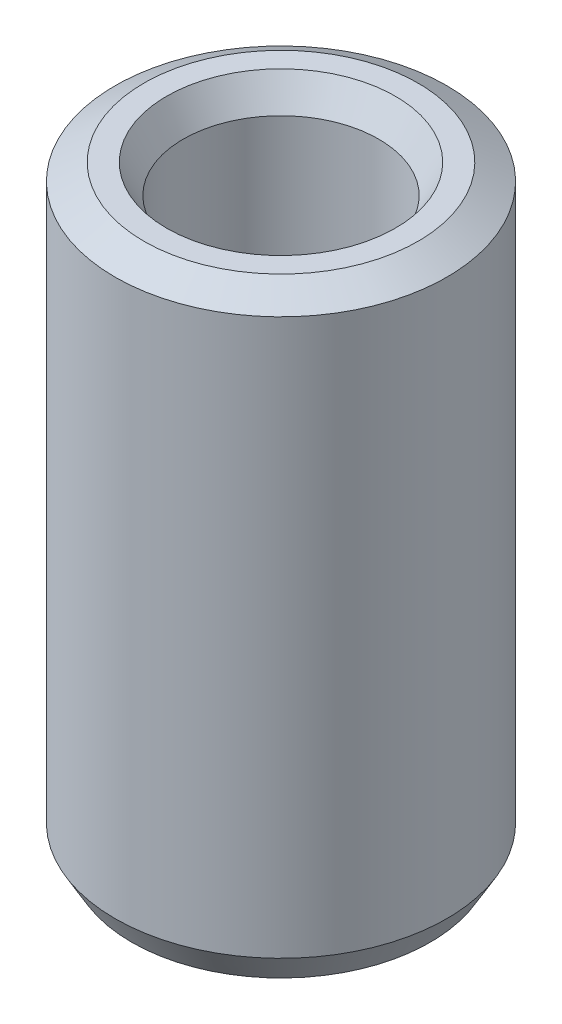
ISO-10303-21;
HEADER;
FILE_DESCRIPTION(('STEP AP214'),'2;1');
FILE_NAME('part.step','',(''),(''),'','','');
FILE_SCHEMA(('AUTOMOTIVE_DESIGN { 1 0 10303 214 1 1 1 1 }'));
ENDSEC;
DATA;
#1=APPLICATION_CONTEXT('core data for automotive mechanical design processes');
#2=APPLICATION_PROTOCOL_DEFINITION('international standard','automotive_design',2000,#1);
#3=PRODUCT_CONTEXT('',#1,'mechanical');
#4=PRODUCT('Part','Part','',(#3));
#5=PRODUCT_RELATED_PRODUCT_CATEGORY('part','',(#4));
#6=PRODUCT_DEFINITION_FORMATION('','',#4);
#7=PRODUCT_DEFINITION_CONTEXT('part definition',#1,'design');
#8=PRODUCT_DEFINITION('design','',#6,#7);
#9=PRODUCT_DEFINITION_SHAPE('','',#8);
#10=(LENGTH_UNIT() NAMED_UNIT(*) SI_UNIT(.MILLI.,.METRE.));
#11=(NAMED_UNIT(*) PLANE_ANGLE_UNIT() SI_UNIT($,.RADIAN.));
#12=(NAMED_UNIT(*) SI_UNIT($,.STERADIAN.) SOLID_ANGLE_UNIT());
#13=UNCERTAINTY_MEASURE_WITH_UNIT(LENGTH_MEASURE(1.E-05),#10,'distance_accuracy_value','');
#14=(GEOMETRIC_REPRESENTATION_CONTEXT(3) GLOBAL_UNCERTAINTY_ASSIGNED_CONTEXT((#13)) GLOBAL_UNIT_ASSIGNED_CONTEXT((#10,
#11,#12)) REPRESENTATION_CONTEXT('',''));
#15=CARTESIAN_POINT('',(0.,0.,0.));
#16=DIRECTION('',(0.,0.,1.));
#17=DIRECTION('',(1.,0.,0.));
#18=AXIS2_PLACEMENT_3D('',#15,#16,#17);
#19=CARTESIAN_POINT('',(0.,135.869374457949,0.));
#20=DIRECTION('',(0.,-1.,0.));
#21=DIRECTION('',(0.,0.,-1.));
#22=AXIS2_PLACEMENT_3D('',#19,#20,#21);
#23=CYLINDRICAL_SURFACE('',#22,37.5);
#24=CARTESIAN_POINT('',(0.,6.51703226795025,0.));
#25=DIRECTION('',(0.,1.,0.));
#26=DIRECTION('',(0.,0.,1.));
#27=AXIS2_PLACEMENT_3D('',#24,#25,#26);
#28=CIRCLE('',#27,37.5);
#29=CARTESIAN_POINT('',(0.,6.51703226795025,37.5));
#30=VERTEX_POINT('',#29);
#31=EDGE_CURVE('E10',#30,#30,#28,.T.);
#32=ORIENTED_EDGE('',*,*,#31,.T.);
#33=EDGE_LOOP('',(#32));
#34=FACE_BOUND('',#33,.T.);
#35=CARTESIAN_POINT('',(0.,132.106764123731,0.));
#36=DIRECTION('',(0.,1.,0.));
#37=DIRECTION('',(0.,0.,1.));
#38=AXIS2_PLACEMENT_3D('',#35,#36,#37);
#39=CIRCLE('',#38,37.5);
#40=CARTESIAN_POINT('',(0.,132.106764123731,37.5));
#41=VERTEX_POINT('',#40);
#42=EDGE_CURVE('E50',#41,#41,#39,.F.);
#43=ORIENTED_EDGE('',*,*,#42,.T.);
#44=EDGE_LOOP('',(#43));
#45=FACE_BOUND('',#44,.T.);
#46=ADVANCED_FACE('F39',(#34,#45),#23,.T.);
#47=CARTESIAN_POINT('',(0.,135.869374457949,0.));
#48=DIRECTION('',(0.,1.,0.));
#49=DIRECTION('',(0.,0.,1.));
#50=AXIS2_PLACEMENT_3D('',#47,#48,#49);
#51=PLANE('',#50);
#52=CARTESIAN_POINT('',(0.,135.869374457949,0.));
#53=DIRECTION('',(0.,1.,0.));
#54=DIRECTION('',(0.,0.,1.));
#55=AXIS2_PLACEMENT_3D('',#52,#53,#54);
#56=CIRCLE('',#55,25.8548530227958);
#57=CARTESIAN_POINT('',(0.,135.869374457949,25.8548530227958));
#58=VERTEX_POINT('',#57);
#59=EDGE_CURVE('E58',#58,#58,#56,.F.);
#60=ORIENTED_EDGE('',*,*,#59,.T.);
#61=EDGE_LOOP('',(#60));
#62=FACE_BOUND('',#61,.T.);
#63=CARTESIAN_POINT('',(0.,135.869374457949,0.));
#64=DIRECTION('',(0.,1.,0.));
#65=DIRECTION('',(0.,0.,1.));
#66=AXIS2_PLACEMENT_3D('',#63,#64,#65);
#67=CIRCLE('',#66,30.9829677320498);
#68=CARTESIAN_POINT('',(0.,135.869374457949,30.9829677320498));
#69=VERTEX_POINT('',#68);
#70=EDGE_CURVE('E61',#69,#69,#67,.T.);
#71=ORIENTED_EDGE('',*,*,#70,.T.);
#72=EDGE_LOOP('',(#71));
#73=FACE_BOUND('',#72,.T.);
#74=ADVANCED_FACE('F88',(#62,#73),#51,.T.);
#75=CARTESIAN_POINT('',(0.,0.,0.));
#76=DIRECTION('',(0.,1.,0.));
#77=DIRECTION('',(0.,0.,1.));
#78=AXIS2_PLACEMENT_3D('',#75,#76,#77);
#79=PLANE('',#78);
#80=CARTESIAN_POINT('',(0.,0.,0.));
#81=DIRECTION('',(0.,1.,0.));
#82=DIRECTION('',(0.,0.,1.));
#83=AXIS2_PLACEMENT_3D('',#80,#81,#82);
#84=CIRCLE('',#83,28.6092749565274);
#85=CARTESIAN_POINT('',(0.,0.,28.6092749565274));
#86=VERTEX_POINT('',#85);
#87=EDGE_CURVE('E51',#86,#86,#84,.T.);
#88=ORIENTED_EDGE('',*,*,#87,.T.);
#89=EDGE_LOOP('',(#88));
#90=FACE_BOUND('',#89,.T.);
#91=CARTESIAN_POINT('',(0.,0.,0.));
#92=DIRECTION('',(0.,1.,0.));
#93=DIRECTION('',(0.,0.,1.));
#94=AXIS2_PLACEMENT_3D('',#91,#92,#93);
#95=CIRCLE('',#94,33.7373896657814);
#96=CARTESIAN_POINT('',(0.,0.,33.7373896657814));
#97=VERTEX_POINT('',#96);
#98=EDGE_CURVE('E54',#97,#97,#95,.F.);
#99=ORIENTED_EDGE('',*,*,#98,.T.);
#100=EDGE_LOOP('',(#99));
#101=FACE_BOUND('',#100,.T.);
#102=ADVANCED_FACE('F83',(#90,#101),#79,.F.);
#103=CARTESIAN_POINT('',(0.,135.869374457949,0.));
#104=DIRECTION('',(0.,-1.,0.));
#105=DIRECTION('',(0.,0.,-1.));
#106=AXIS2_PLACEMENT_3D('',#103,#104,#105);
#107=CYLINDRICAL_SURFACE('',#106,22.0922426885772);
#108=CARTESIAN_POINT('',(0.,129.352342189999,0.));
#109=DIRECTION('',(0.,1.,0.));
#110=DIRECTION('',(0.,0.,1.));
#111=AXIS2_PLACEMENT_3D('',#108,#109,#110);
#112=CIRCLE('',#111,22.0922426885772);
#113=CARTESIAN_POINT('',(0.,129.352342189999,22.0922426885772));
#114=VERTEX_POINT('',#113);
#115=EDGE_CURVE('E67',#114,#114,#112,.T.);
#116=ORIENTED_EDGE('',*,*,#115,.T.);
#117=EDGE_LOOP('',(#116));
#118=FACE_BOUND('',#117,.T.);
#119=CARTESIAN_POINT('',(0.,3.76261033421857,0.));
#120=DIRECTION('',(0.,1.,0.));
#121=DIRECTION('',(0.,0.,1.));
#122=AXIS2_PLACEMENT_3D('',#119,#120,#121);
#123=CIRCLE('',#122,22.0922426885772);
#124=CARTESIAN_POINT('',(0.,3.76261033421857,22.0922426885772));
#125=VERTEX_POINT('',#124);
#126=EDGE_CURVE('E69',#125,#125,#123,.F.);
#127=ORIENTED_EDGE('',*,*,#126,.T.);
#128=EDGE_LOOP('',(#127));
#129=FACE_BOUND('',#128,.T.);
#130=ADVANCED_FACE('F71',(#118,#129),#107,.F.);
#131=CARTESIAN_POINT('',(0.,129.352342189999,0.));
#132=DIRECTION('',(0.,1.,0.));
#133=DIRECTION('',(0.,0.,1.));
#134=AXIS2_PLACEMENT_3D('',#131,#132,#133);
#135=CONICAL_SURFACE('',#134,22.0922426885772,0.523598775598301);
#136=ORIENTED_EDGE('',*,*,#59,.F.);
#137=EDGE_LOOP('',(#136));
#138=FACE_BOUND('',#137,.T.);
#139=ORIENTED_EDGE('',*,*,#115,.F.);
#140=EDGE_LOOP('',(#139));
#141=FACE_BOUND('',#140,.T.);
#142=ADVANCED_FACE('F77',(#138,#141),#135,.F.);
#143=CARTESIAN_POINT('',(0.,0.,0.));
#144=DIRECTION('',(0.,-1.,0.));
#145=DIRECTION('',(0.,0.,-1.));
#146=AXIS2_PLACEMENT_3D('',#143,#144,#145);
#147=CONICAL_SURFACE('',#146,28.6092749565274,1.04719755119659);
#148=ORIENTED_EDGE('',*,*,#126,.F.);
#149=EDGE_LOOP('',(#148));
#150=FACE_BOUND('',#149,.T.);
#151=ORIENTED_EDGE('',*,*,#87,.F.);
#152=EDGE_LOOP('',(#151));
#153=FACE_BOUND('',#152,.T.);
#154=ADVANCED_FACE('F73',(#150,#153),#147,.F.);
#155=CARTESIAN_POINT('',(0.,6.51703226795025,0.));
#156=DIRECTION('',(0.,1.,0.));
#157=DIRECTION('',(0.,0.,1.));
#158=AXIS2_PLACEMENT_3D('',#155,#156,#157);
#159=CONICAL_SURFACE('',#158,37.5,0.523598775598301);
#160=ORIENTED_EDGE('',*,*,#98,.F.);
#161=EDGE_LOOP('',(#160));
#162=FACE_BOUND('',#161,.T.);
#163=ORIENTED_EDGE('',*,*,#31,.F.);
#164=EDGE_LOOP('',(#163));
#165=FACE_BOUND('',#164,.T.);
#166=ADVANCED_FACE('F76',(#162,#165),#159,.T.);
#167=CARTESIAN_POINT('',(0.,135.869374457949,0.));
#168=DIRECTION('',(0.,-1.,0.));
#169=DIRECTION('',(0.,0.,-1.));
#170=AXIS2_PLACEMENT_3D('',#167,#168,#169);
#171=CONICAL_SURFACE('',#170,30.9829677320498,1.04719755119659);
#172=ORIENTED_EDGE('',*,*,#42,.F.);
#173=EDGE_LOOP('',(#172));
#174=FACE_BOUND('',#173,.T.);
#175=ORIENTED_EDGE('',*,*,#70,.F.);
#176=EDGE_LOOP('',(#175));
#177=FACE_BOUND('',#176,.T.);
#178=ADVANCED_FACE('F45',(#174,#177),#171,.T.);
#179=CLOSED_SHELL('',(#46,#74,#102,#130,#142,#154,#166,#178));
#180=MANIFOLD_SOLID_BREP('B2',#179);
#181=ADVANCED_BREP_SHAPE_REPRESENTATION('',(#18,#180),#14);
#182=SHAPE_DEFINITION_REPRESENTATION(#9,#181);
ENDSEC;
END-ISO-10303-21;
